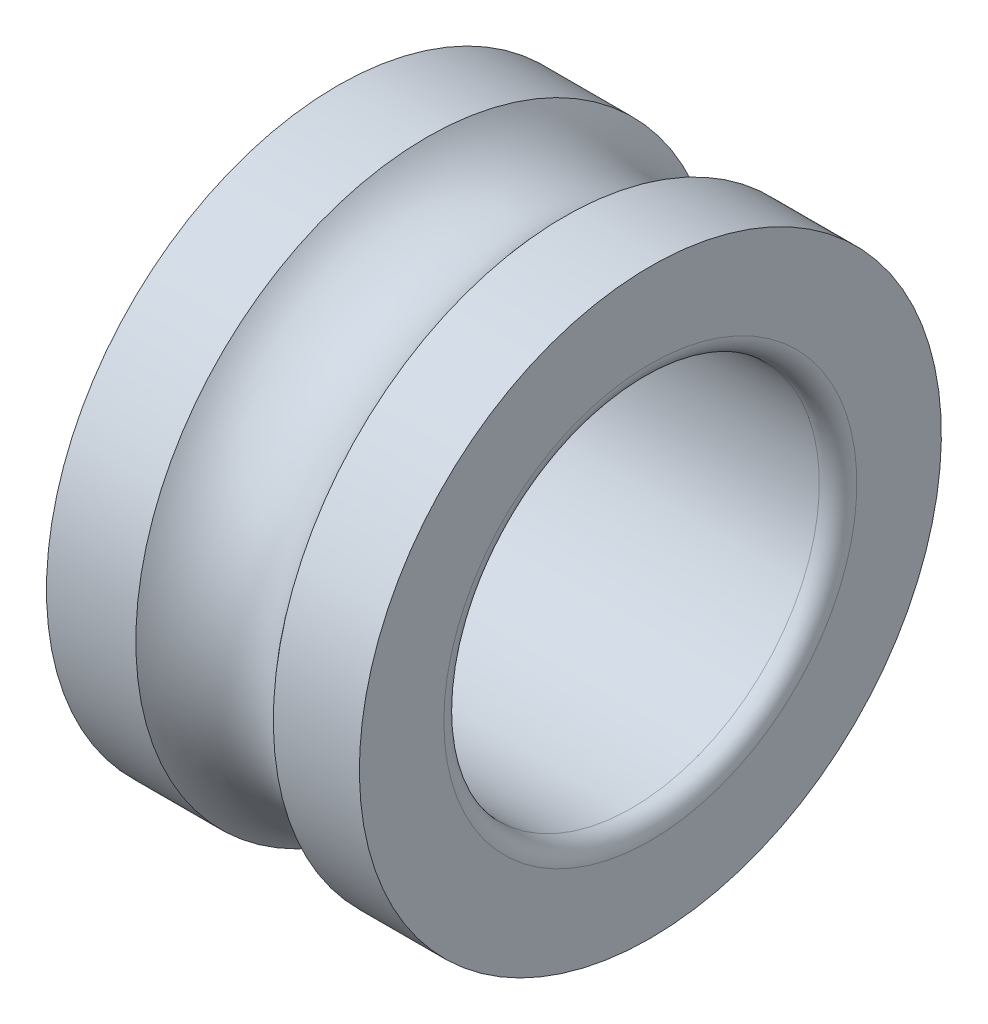
ISO-10303-21;
HEADER;
FILE_DESCRIPTION(('STEP AP214'),'2;1');
FILE_NAME('part.step','',(''),(''),'','','');
FILE_SCHEMA(('AUTOMOTIVE_DESIGN { 1 0 10303 214 1 1 1 1 }'));
ENDSEC;
DATA;
#1=APPLICATION_CONTEXT('core data for automotive mechanical design processes');
#2=APPLICATION_PROTOCOL_DEFINITION('international standard','automotive_design',2000,#1);
#3=PRODUCT_CONTEXT('',#1,'mechanical');
#4=PRODUCT('Part','Part','',(#3));
#5=PRODUCT_RELATED_PRODUCT_CATEGORY('part','',(#4));
#6=PRODUCT_DEFINITION_FORMATION('','',#4);
#7=PRODUCT_DEFINITION_CONTEXT('part definition',#1,'design');
#8=PRODUCT_DEFINITION('design','',#6,#7);
#9=PRODUCT_DEFINITION_SHAPE('','',#8);
#10=(LENGTH_UNIT() NAMED_UNIT(*) SI_UNIT(.MILLI.,.METRE.));
#11=(NAMED_UNIT(*) PLANE_ANGLE_UNIT() SI_UNIT($,.RADIAN.));
#12=(NAMED_UNIT(*) SI_UNIT($,.STERADIAN.) SOLID_ANGLE_UNIT());
#13=UNCERTAINTY_MEASURE_WITH_UNIT(LENGTH_MEASURE(1.E-05),#10,'distance_accuracy_value','');
#14=(GEOMETRIC_REPRESENTATION_CONTEXT(3) GLOBAL_UNCERTAINTY_ASSIGNED_CONTEXT((#13)) GLOBAL_UNIT_ASSIGNED_CONTEXT((#10,
#11,#12)) REPRESENTATION_CONTEXT('',''));
#15=CARTESIAN_POINT('',(0.,0.,0.));
#16=DIRECTION('',(0.,0.,1.));
#17=DIRECTION('',(1.,0.,0.));
#18=AXIS2_PLACEMENT_3D('',#15,#16,#17);
#19=CARTESIAN_POINT('',(0.,7.95,0.));
#20=DIRECTION('',(-1.,0.,0.));
#21=DIRECTION('',(0.,0.,1.));
#22=AXIS2_PLACEMENT_3D('',#19,#20,#21);
#23=PLANE('',#22);
#24=CARTESIAN_POINT('',(0.,0.,0.));
#25=DIRECTION('',(1.,0.,0.));
#26=DIRECTION('',(0.,1.,0.));
#27=AXIS2_PLACEMENT_3D('',#24,#25,#26);
#28=CIRCLE('',#27,6.6);
#29=CARTESIAN_POINT('',(0.,0.,6.6));
#30=VERTEX_POINT('',#29);
#31=EDGE_CURVE('E69',#30,#30,#28,.T.);
#32=ORIENTED_EDGE('',*,*,#31,.T.);
#33=EDGE_LOOP('',(#32));
#34=FACE_BOUND('',#33,.T.);
#35=CARTESIAN_POINT('',(0.,0.,0.));
#36=DIRECTION('',(1.,0.,0.));
#37=DIRECTION('',(0.,1.,0.));
#38=AXIS2_PLACEMENT_3D('',#35,#36,#37);
#39=CIRCLE('',#38,9.3);
#40=CARTESIAN_POINT('',(0.,-9.3,0.));
#41=VERTEX_POINT('',#40);
#42=EDGE_CURVE('E75',#41,#41,#39,.T.);
#43=ORIENTED_EDGE('',*,*,#42,.F.);
#44=EDGE_LOOP('',(#43));
#45=FACE_BOUND('',#44,.T.);
#46=ADVANCED_FACE('F17',(#34,#45),#23,.T.);
#47=CARTESIAN_POINT('',(10.,7.95,0.));
#48=DIRECTION('',(1.,0.,0.));
#49=DIRECTION('',(0.,1.,0.));
#50=AXIS2_PLACEMENT_3D('',#47,#48,#49);
#51=PLANE('',#50);
#52=CARTESIAN_POINT('',(10.,0.,0.));
#53=DIRECTION('',(1.,0.,0.));
#54=DIRECTION('',(0.,1.,0.));
#55=AXIS2_PLACEMENT_3D('',#52,#53,#54);
#56=CIRCLE('',#55,6.6);
#57=CARTESIAN_POINT('',(10.,0.,6.6));
#58=VERTEX_POINT('',#57);
#59=EDGE_CURVE('E11',#58,#58,#56,.T.);
#60=ORIENTED_EDGE('',*,*,#59,.F.);
#61=EDGE_LOOP('',(#60));
#62=FACE_BOUND('',#61,.T.);
#63=CARTESIAN_POINT('',(10.,0.,0.));
#64=DIRECTION('',(1.,0.,0.));
#65=DIRECTION('',(0.,1.,0.));
#66=AXIS2_PLACEMENT_3D('',#63,#64,#65);
#67=CIRCLE('',#66,9.3);
#68=CARTESIAN_POINT('',(10.,-9.3,0.));
#69=VERTEX_POINT('',#68);
#70=EDGE_CURVE('E84',#69,#69,#67,.T.);
#71=ORIENTED_EDGE('',*,*,#70,.T.);
#72=EDGE_LOOP('',(#71));
#73=FACE_BOUND('',#72,.T.);
#74=ADVANCED_FACE('F96',(#62,#73),#51,.T.);
#75=CARTESIAN_POINT('',(9.4,0.,0.));
#76=DIRECTION('',(1.,0.,0.));
#77=DIRECTION('',(0.,0.,-1.));
#78=AXIS2_PLACEMENT_3D('',#75,#76,#77);
#79=TOROIDAL_SURFACE('',#78,6.6,0.6);
#80=ORIENTED_EDGE('',*,*,#59,.T.);
#81=EDGE_LOOP('',(#80));
#82=FACE_BOUND('',#81,.T.);
#83=CARTESIAN_POINT('',(9.4,0.,0.));
#84=DIRECTION('',(1.,0.,0.));
#85=DIRECTION('',(0.,1.,0.));
#86=AXIS2_PLACEMENT_3D('',#83,#84,#85);
#87=CIRCLE('',#86,6.);
#88=CARTESIAN_POINT('',(9.4,0.,6.));
#89=VERTEX_POINT('',#88);
#90=EDGE_CURVE('E21',#89,#89,#87,.T.);
#91=ORIENTED_EDGE('',*,*,#90,.F.);
#92=EDGE_LOOP('',(#91));
#93=FACE_BOUND('',#92,.T.);
#94=ADVANCED_FACE('F19',(#82,#93),#79,.T.);
#95=CARTESIAN_POINT('',(5.,0.,0.));
#96=DIRECTION('',(1.,0.,0.));
#97=DIRECTION('',(0.,1.,0.));
#98=AXIS2_PLACEMENT_3D('',#95,#96,#97);
#99=CYLINDRICAL_SURFACE('',#98,6.);
#100=CARTESIAN_POINT('',(0.6,0.,0.));
#101=DIRECTION('',(1.,0.,0.));
#102=DIRECTION('',(0.,1.,0.));
#103=AXIS2_PLACEMENT_3D('',#100,#101,#102);
#104=CIRCLE('',#103,6.);
#105=CARTESIAN_POINT('',(0.6,-6.,0.));
#106=VERTEX_POINT('',#105);
#107=EDGE_CURVE('E64',#106,#106,#104,.T.);
#108=ORIENTED_EDGE('',*,*,#107,.F.);
#109=EDGE_LOOP('',(#108));
#110=FACE_BOUND('',#109,.T.);
#111=ORIENTED_EDGE('',*,*,#90,.T.);
#112=EDGE_LOOP('',(#111));
#113=FACE_BOUND('',#112,.T.);
#114=ADVANCED_FACE('F111',(#110,#113),#99,.F.);
#115=CARTESIAN_POINT('',(0.6,0.,0.));
#116=DIRECTION('',(1.,0.,0.));
#117=DIRECTION('',(0.,0.,-1.));
#118=AXIS2_PLACEMENT_3D('',#115,#116,#117);
#119=TOROIDAL_SURFACE('',#118,6.6,0.6);
#120=ORIENTED_EDGE('',*,*,#107,.T.);
#121=EDGE_LOOP('',(#120));
#122=FACE_BOUND('',#121,.T.);
#123=ORIENTED_EDGE('',*,*,#31,.F.);
#124=EDGE_LOOP('',(#123));
#125=FACE_BOUND('',#124,.T.);
#126=ADVANCED_FACE('F65',(#122,#125),#119,.T.);
#127=CARTESIAN_POINT('',(1.42772539197992,0.,0.));
#128=DIRECTION('',(1.,0.,0.));
#129=DIRECTION('',(0.,1.,0.));
#130=AXIS2_PLACEMENT_3D('',#127,#128,#129);
#131=CYLINDRICAL_SURFACE('',#130,9.3);
#132=ORIENTED_EDGE('',*,*,#42,.T.);
#133=EDGE_LOOP('',(#132));
#134=FACE_BOUND('',#133,.T.);
#135=CARTESIAN_POINT('',(2.85545078395985,0.,0.));
#136=DIRECTION('',(1.,0.,0.));
#137=DIRECTION('',(0.,1.,0.));
#138=AXIS2_PLACEMENT_3D('',#135,#136,#137);
#139=CIRCLE('',#138,9.3);
#140=CARTESIAN_POINT('',(2.85545078395985,9.3,0.));
#141=VERTEX_POINT('',#140);
#142=EDGE_CURVE('E79',#141,#141,#139,.T.);
#143=ORIENTED_EDGE('',*,*,#142,.F.);
#144=EDGE_LOOP('',(#143));
#145=FACE_BOUND('',#144,.T.);
#146=ADVANCED_FACE('F92',(#134,#145),#131,.T.);
#147=CARTESIAN_POINT('',(8.62483349127773,0.,0.));
#148=DIRECTION('',(1.,0.,0.));
#149=DIRECTION('',(0.,1.,0.));
#150=AXIS2_PLACEMENT_3D('',#147,#148,#149);
#151=CYLINDRICAL_SURFACE('',#150,9.3);
#152=CARTESIAN_POINT('',(7.24966698255545,0.,0.));
#153=DIRECTION('',(1.,0.,0.));
#154=DIRECTION('',(0.,1.,0.));
#155=AXIS2_PLACEMENT_3D('',#152,#153,#154);
#156=CIRCLE('',#155,9.3);
#157=CARTESIAN_POINT('',(7.24966698255545,-9.3,0.));
#158=VERTEX_POINT('',#157);
#159=EDGE_CURVE('E82',#158,#158,#156,.T.);
#160=ORIENTED_EDGE('',*,*,#159,.T.);
#161=EDGE_LOOP('',(#160));
#162=FACE_BOUND('',#161,.T.);
#163=ORIENTED_EDGE('',*,*,#70,.F.);
#164=EDGE_LOOP('',(#163));
#165=FACE_BOUND('',#164,.T.);
#166=ADVANCED_FACE('F109',(#162,#165),#151,.T.);
#167=CARTESIAN_POINT('',(5.05255888325765,0.,0.));
#168=DIRECTION('',(1.,0.,0.));
#169=DIRECTION('',(0.,0.,-1.));
#170=AXIS2_PLACEMENT_3D('',#167,#168,#169);
#171=TOROIDAL_SURFACE('',#170,11.,2.778);
#172=ORIENTED_EDGE('',*,*,#159,.F.);
#173=EDGE_LOOP('',(#172));
#174=FACE_BOUND('',#173,.T.);
#175=ORIENTED_EDGE('',*,*,#142,.T.);
#176=EDGE_LOOP('',(#175));
#177=FACE_BOUND('',#176,.T.);
#178=ADVANCED_FACE('F106',(#174,#177),#171,.F.);
#179=CLOSED_SHELL('',(#46,#74,#94,#114,#126,#146,#166,#178));
#180=MANIFOLD_SOLID_BREP('B1',#179);
#181=ADVANCED_BREP_SHAPE_REPRESENTATION('',(#18,#180),#14);
#182=SHAPE_DEFINITION_REPRESENTATION(#9,#181);
ENDSEC;
END-ISO-10303-21;
